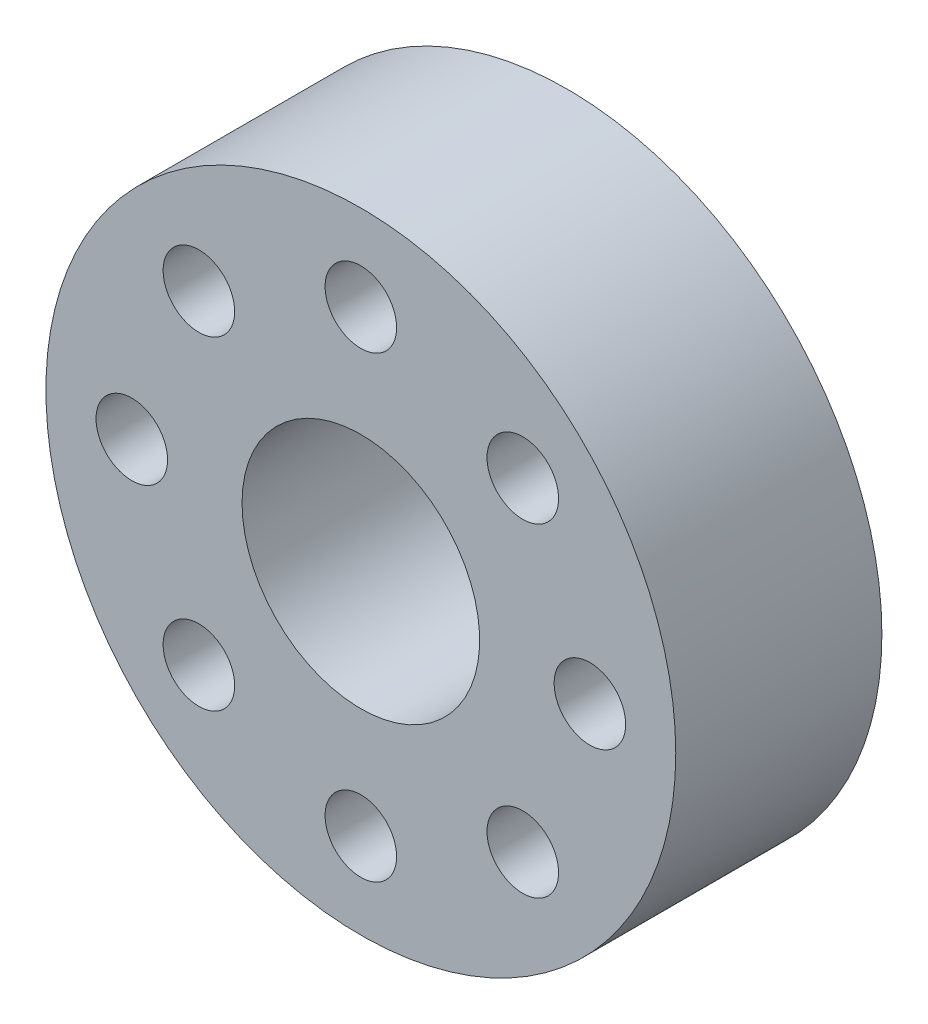
ISO-10303-21;
HEADER;
FILE_DESCRIPTION(('STEP AP214'),'2;1');
FILE_NAME('part.step','',(''),(''),'','','');
FILE_SCHEMA(('AUTOMOTIVE_DESIGN { 1 0 10303 214 1 1 1 1 }'));
ENDSEC;
DATA;
#1=APPLICATION_CONTEXT('core data for automotive mechanical design processes');
#2=APPLICATION_PROTOCOL_DEFINITION('international standard','automotive_design',2000,#1);
#3=PRODUCT_CONTEXT('',#1,'mechanical');
#4=PRODUCT('Part','Part','',(#3));
#5=PRODUCT_RELATED_PRODUCT_CATEGORY('part','',(#4));
#6=PRODUCT_DEFINITION_FORMATION('','',#4);
#7=PRODUCT_DEFINITION_CONTEXT('part definition',#1,'design');
#8=PRODUCT_DEFINITION('design','',#6,#7);
#9=PRODUCT_DEFINITION_SHAPE('','',#8);
#10=(LENGTH_UNIT() NAMED_UNIT(*) SI_UNIT(.MILLI.,.METRE.));
#11=(NAMED_UNIT(*) PLANE_ANGLE_UNIT() SI_UNIT($,.RADIAN.));
#12=(NAMED_UNIT(*) SI_UNIT($,.STERADIAN.) SOLID_ANGLE_UNIT());
#13=UNCERTAINTY_MEASURE_WITH_UNIT(LENGTH_MEASURE(1.E-05),#10,'distance_accuracy_value','');
#14=(GEOMETRIC_REPRESENTATION_CONTEXT(3) GLOBAL_UNCERTAINTY_ASSIGNED_CONTEXT((#13)) GLOBAL_UNIT_ASSIGNED_CONTEXT((#10,
#11,#12)) REPRESENTATION_CONTEXT('',''));
#15=CARTESIAN_POINT('',(0.,0.,0.));
#16=DIRECTION('',(0.,0.,1.));
#17=DIRECTION('',(1.,0.,0.));
#18=AXIS2_PLACEMENT_3D('',#15,#16,#17);
#19=CARTESIAN_POINT('',(0.,0.,7.2));
#20=DIRECTION('',(0.,0.,-1.));
#21=DIRECTION('',(-1.,0.,0.));
#22=AXIS2_PLACEMENT_3D('',#19,#20,#21);
#23=CYLINDRICAL_SURFACE('',#22,11.);
#24=CARTESIAN_POINT('',(0.,0.,7.2));
#25=DIRECTION('',(0.,0.,1.));
#26=DIRECTION('',(1.,0.,0.));
#27=AXIS2_PLACEMENT_3D('',#24,#25,#26);
#28=CIRCLE('',#27,11.);
#29=CARTESIAN_POINT('',(11.,0.,7.2));
#30=VERTEX_POINT('',#29);
#31=EDGE_CURVE('E10',#30,#30,#28,.T.);
#32=ORIENTED_EDGE('',*,*,#31,.F.);
#33=EDGE_LOOP('',(#32));
#34=FACE_BOUND('',#33,.T.);
#35=CARTESIAN_POINT('',(0.,0.,0.));
#36=DIRECTION('',(0.,0.,1.));
#37=DIRECTION('',(1.,0.,0.));
#38=AXIS2_PLACEMENT_3D('',#35,#36,#37);
#39=CIRCLE('',#38,11.);
#40=CARTESIAN_POINT('',(11.,0.,0.));
#41=VERTEX_POINT('',#40);
#42=EDGE_CURVE('E46',#41,#41,#39,.T.);
#43=ORIENTED_EDGE('',*,*,#42,.T.);
#44=EDGE_LOOP('',(#43));
#45=FACE_BOUND('',#44,.T.);
#46=ADVANCED_FACE('F43',(#34,#45),#23,.T.);
#47=CARTESIAN_POINT('',(0.,0.,7.2));
#48=DIRECTION('',(0.,0.,1.));
#49=DIRECTION('',(1.,0.,0.));
#50=AXIS2_PLACEMENT_3D('',#47,#48,#49);
#51=PLANE('',#50);
#52=CARTESIAN_POINT('',(-8.,0.,7.2));
#53=DIRECTION('',(0.,0.,-1.));
#54=DIRECTION('',(-1.,0.,0.));
#55=AXIS2_PLACEMENT_3D('',#52,#53,#54);
#56=CIRCLE('',#55,1.25);
#57=CARTESIAN_POINT('',(-9.25,0.,7.2));
#58=VERTEX_POINT('',#57);
#59=EDGE_CURVE('E90',#58,#58,#56,.T.);
#60=ORIENTED_EDGE('',*,*,#59,.T.);
#61=EDGE_LOOP('',(#60));
#62=FACE_BOUND('',#61,.T.);
#63=CARTESIAN_POINT('',(-5.65685424949237,-5.65685424949239,7.2));
#64=DIRECTION('',(0.,0.,-1.));
#65=DIRECTION('',(-1.,0.,0.));
#66=AXIS2_PLACEMENT_3D('',#63,#64,#65);
#67=CIRCLE('',#66,1.25);
#68=CARTESIAN_POINT('',(-6.90685424949237,-5.65685424949239,7.2));
#69=VERTEX_POINT('',#68);
#70=EDGE_CURVE('E82',#69,#69,#67,.T.);
#71=ORIENTED_EDGE('',*,*,#70,.T.);
#72=EDGE_LOOP('',(#71));
#73=FACE_BOUND('',#72,.T.);
#74=CARTESIAN_POINT('',(0.,-8.,7.2));
#75=DIRECTION('',(0.,0.,-1.));
#76=DIRECTION('',(-1.,0.,0.));
#77=AXIS2_PLACEMENT_3D('',#74,#75,#76);
#78=CIRCLE('',#77,1.25);
#79=CARTESIAN_POINT('',(-1.24999999999997,-8.,7.2));
#80=VERTEX_POINT('',#79);
#81=EDGE_CURVE('E74',#80,#80,#78,.T.);
#82=ORIENTED_EDGE('',*,*,#81,.T.);
#83=EDGE_LOOP('',(#82));
#84=FACE_BOUND('',#83,.T.);
#85=CARTESIAN_POINT('',(5.65685424949241,-5.65685424949235,7.2));
#86=DIRECTION('',(0.,0.,-1.));
#87=DIRECTION('',(-1.,0.,0.));
#88=AXIS2_PLACEMENT_3D('',#85,#86,#87);
#89=CIRCLE('',#88,1.25);
#90=CARTESIAN_POINT('',(4.40685424949241,-5.65685424949235,7.2));
#91=VERTEX_POINT('',#90);
#92=EDGE_CURVE('E65',#91,#91,#89,.T.);
#93=ORIENTED_EDGE('',*,*,#92,.T.);
#94=EDGE_LOOP('',(#93));
#95=FACE_BOUND('',#94,.T.);
#96=CARTESIAN_POINT('',(8.,0.,7.2));
#97=DIRECTION('',(0.,0.,-1.));
#98=DIRECTION('',(-1.,0.,0.));
#99=AXIS2_PLACEMENT_3D('',#96,#97,#98);
#100=CIRCLE('',#99,1.25);
#101=CARTESIAN_POINT('',(6.75,0.,7.2));
#102=VERTEX_POINT('',#101);
#103=EDGE_CURVE('E121',#102,#102,#100,.T.);
#104=ORIENTED_EDGE('',*,*,#103,.T.);
#105=EDGE_LOOP('',(#104));
#106=FACE_BOUND('',#105,.T.);
#107=CARTESIAN_POINT('',(5.65685424949233,5.65685424949243,7.2));
#108=DIRECTION('',(0.,0.,-1.));
#109=DIRECTION('',(-1.,0.,0.));
#110=AXIS2_PLACEMENT_3D('',#107,#108,#109);
#111=CIRCLE('',#110,1.25);
#112=CARTESIAN_POINT('',(4.40685424949233,5.65685424949243,7.2));
#113=VERTEX_POINT('',#112);
#114=EDGE_CURVE('E113',#113,#113,#111,.T.);
#115=ORIENTED_EDGE('',*,*,#114,.T.);
#116=EDGE_LOOP('',(#115));
#117=FACE_BOUND('',#116,.T.);
#118=CARTESIAN_POINT('',(0.,8.,7.2));
#119=DIRECTION('',(0.,0.,-1.));
#120=DIRECTION('',(-1.,0.,0.));
#121=AXIS2_PLACEMENT_3D('',#118,#119,#120);
#122=CIRCLE('',#121,1.25);
#123=CARTESIAN_POINT('',(-1.25000000000008,8.,7.2));
#124=VERTEX_POINT('',#123);
#125=EDGE_CURVE('E105',#124,#124,#122,.T.);
#126=ORIENTED_EDGE('',*,*,#125,.T.);
#127=EDGE_LOOP('',(#126));
#128=FACE_BOUND('',#127,.T.);
#129=CARTESIAN_POINT('',(-5.65685424949245,5.65685424949231,7.2));
#130=DIRECTION('',(0.,0.,-1.));
#131=DIRECTION('',(-1.,0.,0.));
#132=AXIS2_PLACEMENT_3D('',#129,#130,#131);
#133=CIRCLE('',#132,1.25);
#134=CARTESIAN_POINT('',(-6.90685424949245,5.65685424949231,7.2));
#135=VERTEX_POINT('',#134);
#136=EDGE_CURVE('E97',#135,#135,#133,.T.);
#137=ORIENTED_EDGE('',*,*,#136,.T.);
#138=EDGE_LOOP('',(#137));
#139=FACE_BOUND('',#138,.T.);
#140=CARTESIAN_POINT('',(0.,0.,7.2));
#141=DIRECTION('',(0.,0.,-1.));
#142=DIRECTION('',(-1.,0.,0.));
#143=AXIS2_PLACEMENT_3D('',#140,#141,#142);
#144=CIRCLE('',#143,4.15);
#145=CARTESIAN_POINT('',(-4.15,0.,7.2));
#146=VERTEX_POINT('',#145);
#147=EDGE_CURVE('E55',#146,#146,#144,.T.);
#148=ORIENTED_EDGE('',*,*,#147,.T.);
#149=EDGE_LOOP('',(#148));
#150=FACE_BOUND('',#149,.T.);
#151=ORIENTED_EDGE('',*,*,#31,.T.);
#152=EDGE_LOOP('',(#151));
#153=FACE_BOUND('',#152,.T.);
#154=ADVANCED_FACE('F135',(#62,#73,#84,#95,#106,#117,#128,#139,#150,#153),#51,.T.);
#155=CARTESIAN_POINT('',(0.,0.,0.));
#156=DIRECTION('',(0.,0.,1.));
#157=DIRECTION('',(1.,0.,0.));
#158=AXIS2_PLACEMENT_3D('',#155,#156,#157);
#159=PLANE('',#158);
#160=CARTESIAN_POINT('',(-8.,0.,0.));
#161=DIRECTION('',(0.,0.,-1.));
#162=DIRECTION('',(-1.,0.,0.));
#163=AXIS2_PLACEMENT_3D('',#160,#161,#162);
#164=CIRCLE('',#163,1.25);
#165=CARTESIAN_POINT('',(-9.25,0.,0.));
#166=VERTEX_POINT('',#165);
#167=EDGE_CURVE('E61',#166,#166,#164,.T.);
#168=ORIENTED_EDGE('',*,*,#167,.F.);
#169=EDGE_LOOP('',(#168));
#170=FACE_BOUND('',#169,.T.);
#171=CARTESIAN_POINT('',(-5.65685424949237,-5.65685424949239,0.));
#172=DIRECTION('',(0.,0.,-1.));
#173=DIRECTION('',(-1.,0.,0.));
#174=AXIS2_PLACEMENT_3D('',#171,#172,#173);
#175=CIRCLE('',#174,1.25);
#176=CARTESIAN_POINT('',(-6.90685424949237,-5.65685424949239,0.));
#177=VERTEX_POINT('',#176);
#178=EDGE_CURVE('E86',#177,#177,#175,.T.);
#179=ORIENTED_EDGE('',*,*,#178,.F.);
#180=EDGE_LOOP('',(#179));
#181=FACE_BOUND('',#180,.T.);
#182=CARTESIAN_POINT('',(0.,-8.,0.));
#183=DIRECTION('',(0.,0.,-1.));
#184=DIRECTION('',(-1.,0.,0.));
#185=AXIS2_PLACEMENT_3D('',#182,#183,#184);
#186=CIRCLE('',#185,1.25);
#187=CARTESIAN_POINT('',(-1.24999999999997,-8.,0.));
#188=VERTEX_POINT('',#187);
#189=EDGE_CURVE('E78',#188,#188,#186,.T.);
#190=ORIENTED_EDGE('',*,*,#189,.F.);
#191=EDGE_LOOP('',(#190));
#192=FACE_BOUND('',#191,.T.);
#193=CARTESIAN_POINT('',(5.65685424949241,-5.65685424949235,0.));
#194=DIRECTION('',(0.,0.,-1.));
#195=DIRECTION('',(-1.,0.,0.));
#196=AXIS2_PLACEMENT_3D('',#193,#194,#195);
#197=CIRCLE('',#196,1.25);
#198=CARTESIAN_POINT('',(4.40685424949241,-5.65685424949235,0.));
#199=VERTEX_POINT('',#198);
#200=EDGE_CURVE('E69',#199,#199,#197,.T.);
#201=ORIENTED_EDGE('',*,*,#200,.F.);
#202=EDGE_LOOP('',(#201));
#203=FACE_BOUND('',#202,.T.);
#204=CARTESIAN_POINT('',(8.,0.,0.));
#205=DIRECTION('',(0.,0.,-1.));
#206=DIRECTION('',(-1.,0.,0.));
#207=AXIS2_PLACEMENT_3D('',#204,#205,#206);
#208=CIRCLE('',#207,1.25);
#209=CARTESIAN_POINT('',(6.75,0.,0.));
#210=VERTEX_POINT('',#209);
#211=EDGE_CURVE('E70',#210,#210,#208,.T.);
#212=ORIENTED_EDGE('',*,*,#211,.F.);
#213=EDGE_LOOP('',(#212));
#214=FACE_BOUND('',#213,.T.);
#215=CARTESIAN_POINT('',(5.65685424949233,5.65685424949243,0.));
#216=DIRECTION('',(0.,0.,-1.));
#217=DIRECTION('',(-1.,0.,0.));
#218=AXIS2_PLACEMENT_3D('',#215,#216,#217);
#219=CIRCLE('',#218,1.25);
#220=CARTESIAN_POINT('',(4.40685424949233,5.65685424949243,0.));
#221=VERTEX_POINT('',#220);
#222=EDGE_CURVE('E117',#221,#221,#219,.T.);
#223=ORIENTED_EDGE('',*,*,#222,.F.);
#224=EDGE_LOOP('',(#223));
#225=FACE_BOUND('',#224,.T.);
#226=CARTESIAN_POINT('',(0.,8.,0.));
#227=DIRECTION('',(0.,0.,-1.));
#228=DIRECTION('',(-1.,0.,0.));
#229=AXIS2_PLACEMENT_3D('',#226,#227,#228);
#230=CIRCLE('',#229,1.25);
#231=CARTESIAN_POINT('',(-1.25000000000008,8.,0.));
#232=VERTEX_POINT('',#231);
#233=EDGE_CURVE('E109',#232,#232,#230,.T.);
#234=ORIENTED_EDGE('',*,*,#233,.F.);
#235=EDGE_LOOP('',(#234));
#236=FACE_BOUND('',#235,.T.);
#237=CARTESIAN_POINT('',(-5.65685424949245,5.65685424949231,0.));
#238=DIRECTION('',(0.,0.,-1.));
#239=DIRECTION('',(-1.,0.,0.));
#240=AXIS2_PLACEMENT_3D('',#237,#238,#239);
#241=CIRCLE('',#240,1.25);
#242=CARTESIAN_POINT('',(-6.90685424949245,5.65685424949231,0.));
#243=VERTEX_POINT('',#242);
#244=EDGE_CURVE('E101',#243,#243,#241,.T.);
#245=ORIENTED_EDGE('',*,*,#244,.F.);
#246=EDGE_LOOP('',(#245));
#247=FACE_BOUND('',#246,.T.);
#248=CARTESIAN_POINT('',(0.,0.,0.));
#249=DIRECTION('',(0.,0.,-1.));
#250=DIRECTION('',(-1.,0.,0.));
#251=AXIS2_PLACEMENT_3D('',#248,#249,#250);
#252=CIRCLE('',#251,4.15);
#253=CARTESIAN_POINT('',(-4.15,0.,0.));
#254=VERTEX_POINT('',#253);
#255=EDGE_CURVE('E57',#254,#254,#252,.T.);
#256=ORIENTED_EDGE('',*,*,#255,.F.);
#257=EDGE_LOOP('',(#256));
#258=FACE_BOUND('',#257,.T.);
#259=ORIENTED_EDGE('',*,*,#42,.F.);
#260=EDGE_LOOP('',(#259));
#261=FACE_BOUND('',#260,.T.);
#262=ADVANCED_FACE('F131',(#170,#181,#192,#203,#214,#225,#236,#247,#258,#261),#159,.F.);
#263=CARTESIAN_POINT('',(0.,0.,7.2));
#264=DIRECTION('',(0.,0.,-1.));
#265=DIRECTION('',(-1.,0.,0.));
#266=AXIS2_PLACEMENT_3D('',#263,#264,#265);
#267=CYLINDRICAL_SURFACE('',#266,4.15);
#268=ORIENTED_EDGE('',*,*,#147,.F.);
#269=EDGE_LOOP('',(#268));
#270=FACE_BOUND('',#269,.T.);
#271=ORIENTED_EDGE('',*,*,#255,.T.);
#272=EDGE_LOOP('',(#271));
#273=FACE_BOUND('',#272,.T.);
#274=ADVANCED_FACE('F134',(#270,#273),#267,.F.);
#275=CARTESIAN_POINT('',(-5.65685424949245,5.65685424949231,7.2));
#276=DIRECTION('',(0.,0.,-1.));
#277=DIRECTION('',(-1.,0.,0.));
#278=AXIS2_PLACEMENT_3D('',#275,#276,#277);
#279=CYLINDRICAL_SURFACE('',#278,1.25);
#280=ORIENTED_EDGE('',*,*,#136,.F.);
#281=EDGE_LOOP('',(#280));
#282=FACE_BOUND('',#281,.T.);
#283=ORIENTED_EDGE('',*,*,#244,.T.);
#284=EDGE_LOOP('',(#283));
#285=FACE_BOUND('',#284,.T.);
#286=ADVANCED_FACE('F160',(#282,#285),#279,.F.);
#287=CARTESIAN_POINT('',(0.,8.,7.2));
#288=DIRECTION('',(0.,0.,-1.));
#289=DIRECTION('',(-1.,0.,0.));
#290=AXIS2_PLACEMENT_3D('',#287,#288,#289);
#291=CYLINDRICAL_SURFACE('',#290,1.25);
#292=ORIENTED_EDGE('',*,*,#125,.F.);
#293=EDGE_LOOP('',(#292));
#294=FACE_BOUND('',#293,.T.);
#295=ORIENTED_EDGE('',*,*,#233,.T.);
#296=EDGE_LOOP('',(#295));
#297=FACE_BOUND('',#296,.T.);
#298=ADVANCED_FACE('F180',(#294,#297),#291,.F.);
#299=CARTESIAN_POINT('',(5.65685424949233,5.65685424949243,7.2));
#300=DIRECTION('',(0.,0.,-1.));
#301=DIRECTION('',(-1.,0.,0.));
#302=AXIS2_PLACEMENT_3D('',#299,#300,#301);
#303=CYLINDRICAL_SURFACE('',#302,1.25);
#304=ORIENTED_EDGE('',*,*,#114,.F.);
#305=EDGE_LOOP('',(#304));
#306=FACE_BOUND('',#305,.T.);
#307=ORIENTED_EDGE('',*,*,#222,.T.);
#308=EDGE_LOOP('',(#307));
#309=FACE_BOUND('',#308,.T.);
#310=ADVANCED_FACE('F184',(#306,#309),#303,.F.);
#311=CARTESIAN_POINT('',(8.,0.,7.2));
#312=DIRECTION('',(0.,0.,-1.));
#313=DIRECTION('',(-1.,0.,0.));
#314=AXIS2_PLACEMENT_3D('',#311,#312,#313);
#315=CYLINDRICAL_SURFACE('',#314,1.25);
#316=ORIENTED_EDGE('',*,*,#103,.F.);
#317=EDGE_LOOP('',(#316));
#318=FACE_BOUND('',#317,.T.);
#319=ORIENTED_EDGE('',*,*,#211,.T.);
#320=EDGE_LOOP('',(#319));
#321=FACE_BOUND('',#320,.T.);
#322=ADVANCED_FACE('F129',(#318,#321),#315,.F.);
#323=CARTESIAN_POINT('',(5.65685424949241,-5.65685424949235,7.2));
#324=DIRECTION('',(0.,0.,-1.));
#325=DIRECTION('',(-1.,0.,0.));
#326=AXIS2_PLACEMENT_3D('',#323,#324,#325);
#327=CYLINDRICAL_SURFACE('',#326,1.25);
#328=ORIENTED_EDGE('',*,*,#92,.F.);
#329=EDGE_LOOP('',(#328));
#330=FACE_BOUND('',#329,.T.);
#331=ORIENTED_EDGE('',*,*,#200,.T.);
#332=EDGE_LOOP('',(#331));
#333=FACE_BOUND('',#332,.T.);
#334=ADVANCED_FACE('F162',(#330,#333),#327,.F.);
#335=CARTESIAN_POINT('',(0.,-8.,7.2));
#336=DIRECTION('',(0.,0.,-1.));
#337=DIRECTION('',(-1.,0.,0.));
#338=AXIS2_PLACEMENT_3D('',#335,#336,#337);
#339=CYLINDRICAL_SURFACE('',#338,1.25);
#340=ORIENTED_EDGE('',*,*,#81,.F.);
#341=EDGE_LOOP('',(#340));
#342=FACE_BOUND('',#341,.T.);
#343=ORIENTED_EDGE('',*,*,#189,.T.);
#344=EDGE_LOOP('',(#343));
#345=FACE_BOUND('',#344,.T.);
#346=ADVANCED_FACE('F165',(#342,#345),#339,.F.);
#347=CARTESIAN_POINT('',(-5.65685424949237,-5.65685424949239,7.2));
#348=DIRECTION('',(0.,0.,-1.));
#349=DIRECTION('',(-1.,0.,0.));
#350=AXIS2_PLACEMENT_3D('',#347,#348,#349);
#351=CYLINDRICAL_SURFACE('',#350,1.25);
#352=ORIENTED_EDGE('',*,*,#70,.F.);
#353=EDGE_LOOP('',(#352));
#354=FACE_BOUND('',#353,.T.);
#355=ORIENTED_EDGE('',*,*,#178,.T.);
#356=EDGE_LOOP('',(#355));
#357=FACE_BOUND('',#356,.T.);
#358=ADVANCED_FACE('F169',(#354,#357),#351,.F.);
#359=CARTESIAN_POINT('',(-8.,0.,7.2));
#360=DIRECTION('',(0.,0.,-1.));
#361=DIRECTION('',(-1.,0.,0.));
#362=AXIS2_PLACEMENT_3D('',#359,#360,#361);
#363=CYLINDRICAL_SURFACE('',#362,1.25);
#364=ORIENTED_EDGE('',*,*,#59,.F.);
#365=EDGE_LOOP('',(#364));
#366=FACE_BOUND('',#365,.T.);
#367=ORIENTED_EDGE('',*,*,#167,.T.);
#368=EDGE_LOOP('',(#367));
#369=FACE_BOUND('',#368,.T.);
#370=ADVANCED_FACE('F173',(#366,#369),#363,.F.);
#371=CLOSED_SHELL('',(#46,#154,#262,#274,#286,#298,#310,#322,#334,#346,#358,#370));
#372=MANIFOLD_SOLID_BREP('B2',#371);
#373=ADVANCED_BREP_SHAPE_REPRESENTATION('',(#18,#372),#14);
#374=SHAPE_DEFINITION_REPRESENTATION(#9,#373);
ENDSEC;
END-ISO-10303-21;
